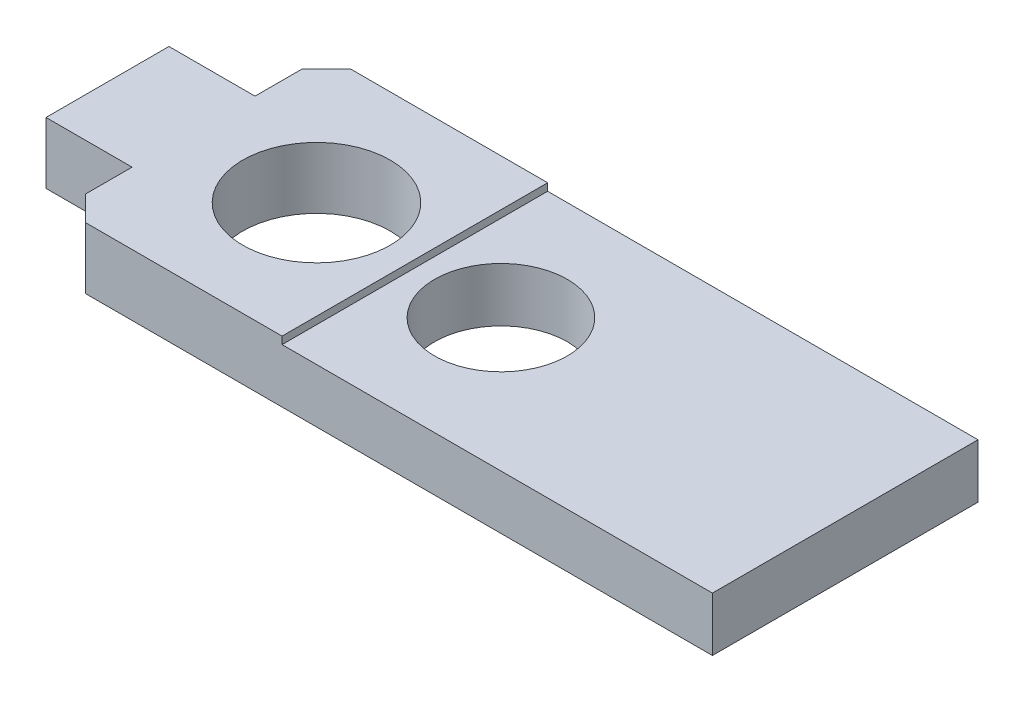
ISO-10303-21;
HEADER;
FILE_DESCRIPTION(('STEP AP214'),'2;1');
FILE_NAME('part.step','',(''),(''),'','','');
FILE_SCHEMA(('AUTOMOTIVE_DESIGN { 1 0 10303 214 1 1 1 1 }'));
ENDSEC;
DATA;
#1=APPLICATION_CONTEXT('core data for automotive mechanical design processes');
#2=APPLICATION_PROTOCOL_DEFINITION('international standard','automotive_design',2000,#1);
#3=PRODUCT_CONTEXT('',#1,'mechanical');
#4=PRODUCT('Part','Part','',(#3));
#5=PRODUCT_RELATED_PRODUCT_CATEGORY('part','',(#4));
#6=PRODUCT_DEFINITION_FORMATION('','',#4);
#7=PRODUCT_DEFINITION_CONTEXT('part definition',#1,'design');
#8=PRODUCT_DEFINITION('design','',#6,#7);
#9=PRODUCT_DEFINITION_SHAPE('','',#8);
#10=(LENGTH_UNIT() NAMED_UNIT(*) SI_UNIT(.MILLI.,.METRE.));
#11=(NAMED_UNIT(*) PLANE_ANGLE_UNIT() SI_UNIT($,.RADIAN.));
#12=(NAMED_UNIT(*) SI_UNIT($,.STERADIAN.) SOLID_ANGLE_UNIT());
#13=UNCERTAINTY_MEASURE_WITH_UNIT(LENGTH_MEASURE(1.E-05),#10,'distance_accuracy_value','');
#14=(GEOMETRIC_REPRESENTATION_CONTEXT(3) GLOBAL_UNCERTAINTY_ASSIGNED_CONTEXT((#13)) GLOBAL_UNIT_ASSIGNED_CONTEXT((#10,
#11,#12)) REPRESENTATION_CONTEXT('',''));
#15=CARTESIAN_POINT('',(0.,0.,0.));
#16=DIRECTION('',(0.,0.,1.));
#17=DIRECTION('',(1.,0.,0.));
#18=AXIS2_PLACEMENT_3D('',#15,#16,#17);
#19=CARTESIAN_POINT('',(-25.,25.,0.));
#20=DIRECTION('',(1.,0.,0.));
#21=DIRECTION('',(0.,0.,-1.));
#22=AXIS2_PLACEMENT_3D('',#19,#20,#21);
#23=PLANE('',#22);
#24=DIRECTION('',(0.,1.,0.));
#25=VECTOR('',#24,1.);
#26=CARTESIAN_POINT('',(-25.,3.88578058618805E-13,-54.));
#27=LINE('',#26,#25);
#28=CARTESIAN_POINT('',(-25.,25.,-54.));
#29=VERTEX_POINT('',#28);
#30=CARTESIAN_POINT('',(-25.,22.,-54.));
#31=VERTEX_POINT('',#30);
#32=EDGE_CURVE('E155',#29,#31,#27,.F.);
#33=ORIENTED_EDGE('',*,*,#32,.F.);
#34=DIRECTION('',(0.,0.,1.));
#35=VECTOR('',#34,1.);
#36=CARTESIAN_POINT('',(-25.,25.,0.));
#37=LINE('',#36,#35);
#38=CARTESIAN_POINT('',(-25.,25.,54.));
#39=VERTEX_POINT('',#38);
#40=EDGE_CURVE('E134',#39,#29,#37,.F.);
#41=ORIENTED_EDGE('',*,*,#40,.F.);
#42=DIRECTION('',(0.,1.,0.));
#43=VECTOR('',#42,1.);
#44=CARTESIAN_POINT('',(-25.,0.,54.));
#45=LINE('',#44,#43);
#46=CARTESIAN_POINT('',(-25.,22.,54.));
#47=VERTEX_POINT('',#46);
#48=EDGE_CURVE('E175',#47,#39,#45,.T.);
#49=ORIENTED_EDGE('',*,*,#48,.F.);
#50=DIRECTION('',(0.,0.,-1.));
#51=VECTOR('',#50,1.);
#52=CARTESIAN_POINT('',(-25.,22.,54.));
#53=LINE('',#52,#51);
#54=EDGE_CURVE('E144',#47,#31,#53,.T.);
#55=ORIENTED_EDGE('',*,*,#54,.T.);
#56=EDGE_LOOP('',(#33,#41,#49,#55));
#57=FACE_BOUND('',#56,.T.);
#58=ADVANCED_FACE('F24',(#57),#23,.T.);
#59=CARTESIAN_POINT('',(150.,22.,54.));
#60=DIRECTION('',(0.,-1.,0.));
#61=DIRECTION('',(0.,0.,-1.));
#62=AXIS2_PLACEMENT_3D('',#59,#60,#61);
#63=PLANE('',#62);
#64=CARTESIAN_POINT('',(10.,22.,0.));
#65=DIRECTION('',(0.,-1.,0.));
#66=DIRECTION('',(0.,0.,-1.));
#67=AXIS2_PLACEMENT_3D('',#64,#65,#66);
#68=CIRCLE('',#67,27.);
#69=CARTESIAN_POINT('',(10.,22.,-27.));
#70=VERTEX_POINT('',#69);
#71=EDGE_CURVE('E27',#70,#70,#68,.T.);
#72=ORIENTED_EDGE('',*,*,#71,.T.);
#73=EDGE_LOOP('',(#72));
#74=FACE_BOUND('',#73,.T.);
#75=DIRECTION('',(-1.,0.,0.));
#76=VECTOR('',#75,1.);
#77=CARTESIAN_POINT('',(150.,22.,-54.));
#78=LINE('',#77,#76);
#79=CARTESIAN_POINT('',(150.,22.,-54.));
#80=VERTEX_POINT('',#79);
#81=EDGE_CURVE('E168',#31,#80,#78,.F.);
#82=ORIENTED_EDGE('',*,*,#81,.F.);
#83=ORIENTED_EDGE('',*,*,#54,.F.);
#84=DIRECTION('',(1.,0.,0.));
#85=VECTOR('',#84,1.);
#86=CARTESIAN_POINT('',(-115.,22.,54.));
#87=LINE('',#86,#85);
#88=CARTESIAN_POINT('',(150.,22.,54.));
#89=VERTEX_POINT('',#88);
#90=EDGE_CURVE('E178',#89,#47,#87,.F.);
#91=ORIENTED_EDGE('',*,*,#90,.F.);
#92=DIRECTION('',(0.,0.,-1.));
#93=VECTOR('',#92,1.);
#94=CARTESIAN_POINT('',(150.,22.,54.));
#95=LINE('',#94,#93);
#96=EDGE_CURVE('E170',#80,#89,#95,.F.);
#97=ORIENTED_EDGE('',*,*,#96,.F.);
#98=EDGE_LOOP('',(#82,#83,#91,#97));
#99=FACE_BOUND('',#98,.T.);
#100=ADVANCED_FACE('F258',(#74,#99),#63,.F.);
#101=CARTESIAN_POINT('',(0.,25.,0.));
#102=DIRECTION('',(0.,1.,0.));
#103=DIRECTION('',(0.,0.,1.));
#104=AXIS2_PLACEMENT_3D('',#101,#102,#103);
#105=PLANE('',#104);
#106=CARTESIAN_POINT('',(-65.,25.,0.));
#107=DIRECTION('',(0.,-1.,0.));
#108=DIRECTION('',(0.,0.,-1.));
#109=AXIS2_PLACEMENT_3D('',#106,#107,#108);
#110=CIRCLE('',#109,30.);
#111=CARTESIAN_POINT('',(-65.,25.,-30.));
#112=VERTEX_POINT('',#111);
#113=EDGE_CURVE('E148',#112,#112,#110,.T.);
#114=ORIENTED_EDGE('',*,*,#113,.T.);
#115=EDGE_LOOP('',(#114));
#116=FACE_BOUND('',#115,.T.);
#117=DIRECTION('',(1.,0.,0.));
#118=VECTOR('',#117,1.);
#119=CARTESIAN_POINT('',(-115.,25.,54.));
#120=LINE('',#119,#118);
#121=CARTESIAN_POINT('',(-105.,25.,54.));
#122=VERTEX_POINT('',#121);
#123=EDGE_CURVE('E183',#39,#122,#120,.F.);
#124=ORIENTED_EDGE('',*,*,#123,.F.);
#125=ORIENTED_EDGE('',*,*,#40,.T.);
#126=DIRECTION('',(-1.,0.,0.));
#127=VECTOR('',#126,1.);
#128=CARTESIAN_POINT('',(150.,25.,-54.));
#129=LINE('',#128,#127);
#130=CARTESIAN_POINT('',(-105.,25.,-54.));
#131=VERTEX_POINT('',#130);
#132=EDGE_CURVE('E130',#131,#29,#129,.F.);
#133=ORIENTED_EDGE('',*,*,#132,.F.);
#134=DIRECTION('',(-0.707106781186548,0.,0.707106781186548));
#135=VECTOR('',#134,1.);
#136=CARTESIAN_POINT('',(-110.,25.,-49.));
#137=LINE('',#136,#135);
#138=CARTESIAN_POINT('',(-115.,25.,-44.));
#139=VERTEX_POINT('',#138);
#140=EDGE_CURVE('E124',#139,#131,#137,.F.);
#141=ORIENTED_EDGE('',*,*,#140,.F.);
#142=DIRECTION('',(0.,0.,1.));
#143=VECTOR('',#142,1.);
#144=CARTESIAN_POINT('',(-115.,25.,-54.));
#145=LINE('',#144,#143);
#146=CARTESIAN_POINT('',(-115.,25.,-25.));
#147=VERTEX_POINT('',#146);
#148=EDGE_CURVE('E115',#147,#139,#145,.F.);
#149=ORIENTED_EDGE('',*,*,#148,.F.);
#150=DIRECTION('',(-1.,0.,0.));
#151=VECTOR('',#150,1.);
#152=CARTESIAN_POINT('',(-115.,25.,-25.));
#153=LINE('',#152,#151);
#154=CARTESIAN_POINT('',(-150.,25.,-25.));
#155=VERTEX_POINT('',#154);
#156=EDGE_CURVE('E110',#155,#147,#153,.F.);
#157=ORIENTED_EDGE('',*,*,#156,.F.);
#158=DIRECTION('',(0.,0.,1.));
#159=VECTOR('',#158,1.);
#160=CARTESIAN_POINT('',(-150.,25.,-25.));
#161=LINE('',#160,#159);
#162=CARTESIAN_POINT('',(-150.,25.,25.));
#163=VERTEX_POINT('',#162);
#164=EDGE_CURVE('E199',#163,#155,#161,.F.);
#165=ORIENTED_EDGE('',*,*,#164,.F.);
#166=DIRECTION('',(1.,0.,0.));
#167=VECTOR('',#166,1.);
#168=CARTESIAN_POINT('',(-150.,25.,25.));
#169=LINE('',#168,#167);
#170=CARTESIAN_POINT('',(-115.,25.,25.));
#171=VERTEX_POINT('',#170);
#172=EDGE_CURVE('E195',#171,#163,#169,.F.);
#173=ORIENTED_EDGE('',*,*,#172,.F.);
#174=DIRECTION('',(0.,0.,1.));
#175=VECTOR('',#174,1.);
#176=CARTESIAN_POINT('',(-115.,25.,25.));
#177=LINE('',#176,#175);
#178=CARTESIAN_POINT('',(-115.,25.,44.));
#179=VERTEX_POINT('',#178);
#180=EDGE_CURVE('E191',#179,#171,#177,.F.);
#181=ORIENTED_EDGE('',*,*,#180,.F.);
#182=DIRECTION('',(0.707106781186548,0.,0.707106781186548));
#183=VECTOR('',#182,1.);
#184=CARTESIAN_POINT('',(-110.,25.,49.));
#185=LINE('',#184,#183);
#186=EDGE_CURVE('E187',#122,#179,#185,.F.);
#187=ORIENTED_EDGE('',*,*,#186,.F.);
#188=EDGE_LOOP('',(#124,#125,#133,#141,#149,#157,#165,#173,#181,#187));
#189=FACE_BOUND('',#188,.T.);
#190=ADVANCED_FACE('F128',(#116,#189),#105,.T.);
#191=CARTESIAN_POINT('',(-110.,12.5000000000004,-49.));
#192=DIRECTION('',(-0.707106781186548,0.,-0.707106781186548));
#193=DIRECTION('',(-0.707106781186548,0.,0.707106781186548));
#194=AXIS2_PLACEMENT_3D('',#191,#192,#193);
#195=PLANE('',#194);
#196=DIRECTION('',(0.,1.,0.));
#197=VECTOR('',#196,1.);
#198=CARTESIAN_POINT('',(-105.,3.88578058618805E-13,-54.));
#199=LINE('',#198,#197);
#200=CARTESIAN_POINT('',(-105.,3.7470027081099E-13,-54.));
#201=VERTEX_POINT('',#200);
#202=EDGE_CURVE('E162',#201,#131,#199,.T.);
#203=ORIENTED_EDGE('',*,*,#202,.F.);
#204=DIRECTION('',(-0.707106781186548,0.,0.707106781186547));
#205=VECTOR('',#204,1.);
#206=CARTESIAN_POINT('',(-105.,3.88578058618805E-13,-54.));
#207=LINE('',#206,#205);
#208=CARTESIAN_POINT('',(-115.,3.7470027081099E-13,-44.));
#209=VERTEX_POINT('',#208);
#210=EDGE_CURVE('E138',#201,#209,#207,.T.);
#211=ORIENTED_EDGE('',*,*,#210,.T.);
#212=DIRECTION('',(0.,1.,0.));
#213=VECTOR('',#212,1.);
#214=CARTESIAN_POINT('',(-115.,3.88578058618805E-13,-44.));
#215=LINE('',#214,#213);
#216=EDGE_CURVE('E120',#139,#209,#215,.F.);
#217=ORIENTED_EDGE('',*,*,#216,.F.);
#218=ORIENTED_EDGE('',*,*,#140,.T.);
#219=EDGE_LOOP('',(#203,#211,#217,#218));
#220=FACE_BOUND('',#219,.T.);
#221=ADVANCED_FACE('F137',(#220),#195,.T.);
#222=CARTESIAN_POINT('',(-115.,3.88578058618805E-13,-54.));
#223=DIRECTION('',(-1.,0.,0.));
#224=DIRECTION('',(0.,0.,1.));
#225=AXIS2_PLACEMENT_3D('',#222,#223,#224);
#226=PLANE('',#225);
#227=ORIENTED_EDGE('',*,*,#148,.T.);
#228=ORIENTED_EDGE('',*,*,#216,.T.);
#229=DIRECTION('',(0.,0.,1.));
#230=VECTOR('',#229,1.);
#231=CARTESIAN_POINT('',(-115.,0.,0.));
#232=LINE('',#231,#230);
#233=CARTESIAN_POINT('',(-115.,0.,-25.));
#234=VERTEX_POINT('',#233);
#235=EDGE_CURVE('E152',#209,#234,#232,.T.);
#236=ORIENTED_EDGE('',*,*,#235,.T.);
#237=DIRECTION('',(0.,1.,0.));
#238=VECTOR('',#237,1.);
#239=CARTESIAN_POINT('',(-115.,0.,-25.));
#240=LINE('',#239,#238);
#241=EDGE_CURVE('E122',#147,#234,#240,.F.);
#242=ORIENTED_EDGE('',*,*,#241,.F.);
#243=EDGE_LOOP('',(#227,#228,#236,#242));
#244=FACE_BOUND('',#243,.T.);
#245=ADVANCED_FACE('F117',(#244),#226,.T.);
#246=CARTESIAN_POINT('',(-115.,0.,-25.));
#247=DIRECTION('',(0.,0.,-1.));
#248=DIRECTION('',(-1.,0.,0.));
#249=AXIS2_PLACEMENT_3D('',#246,#247,#248);
#250=PLANE('',#249);
#251=ORIENTED_EDGE('',*,*,#241,.T.);
#252=DIRECTION('',(1.,0.,0.));
#253=VECTOR('',#252,1.);
#254=CARTESIAN_POINT('',(0.,0.,-25.));
#255=LINE('',#254,#253);
#256=CARTESIAN_POINT('',(-150.,0.,-25.));
#257=VERTEX_POINT('',#256);
#258=EDGE_CURVE('E203',#234,#257,#255,.F.);
#259=ORIENTED_EDGE('',*,*,#258,.T.);
#260=DIRECTION('',(0.,1.,0.));
#261=VECTOR('',#260,1.);
#262=CARTESIAN_POINT('',(-150.,0.,-25.));
#263=LINE('',#262,#261);
#264=EDGE_CURVE('E197',#155,#257,#263,.F.);
#265=ORIENTED_EDGE('',*,*,#264,.F.);
#266=ORIENTED_EDGE('',*,*,#156,.T.);
#267=EDGE_LOOP('',(#251,#259,#265,#266));
#268=FACE_BOUND('',#267,.T.);
#269=ADVANCED_FACE('F202',(#268),#250,.T.);
#270=CARTESIAN_POINT('',(-150.,0.,-25.));
#271=DIRECTION('',(-1.,0.,0.));
#272=DIRECTION('',(0.,0.,1.));
#273=AXIS2_PLACEMENT_3D('',#270,#271,#272);
#274=PLANE('',#273);
#275=ORIENTED_EDGE('',*,*,#264,.T.);
#276=DIRECTION('',(0.,0.,1.));
#277=VECTOR('',#276,1.);
#278=CARTESIAN_POINT('',(-150.,0.,0.));
#279=LINE('',#278,#277);
#280=CARTESIAN_POINT('',(-150.,0.,25.));
#281=VERTEX_POINT('',#280);
#282=EDGE_CURVE('E210',#257,#281,#279,.T.);
#283=ORIENTED_EDGE('',*,*,#282,.T.);
#284=DIRECTION('',(0.,1.,0.));
#285=VECTOR('',#284,1.);
#286=CARTESIAN_POINT('',(-150.,0.,25.));
#287=LINE('',#286,#285);
#288=EDGE_CURVE('E193',#163,#281,#287,.F.);
#289=ORIENTED_EDGE('',*,*,#288,.F.);
#290=ORIENTED_EDGE('',*,*,#164,.T.);
#291=EDGE_LOOP('',(#275,#283,#289,#290));
#292=FACE_BOUND('',#291,.T.);
#293=ADVANCED_FACE('F255',(#292),#274,.T.);
#294=CARTESIAN_POINT('',(-150.,0.,25.));
#295=DIRECTION('',(0.,0.,1.));
#296=DIRECTION('',(1.,0.,0.));
#297=AXIS2_PLACEMENT_3D('',#294,#295,#296);
#298=PLANE('',#297);
#299=ORIENTED_EDGE('',*,*,#288,.T.);
#300=DIRECTION('',(1.,0.,0.));
#301=VECTOR('',#300,1.);
#302=CARTESIAN_POINT('',(0.,0.,25.));
#303=LINE('',#302,#301);
#304=CARTESIAN_POINT('',(-115.,0.,25.));
#305=VERTEX_POINT('',#304);
#306=EDGE_CURVE('E214',#281,#305,#303,.T.);
#307=ORIENTED_EDGE('',*,*,#306,.T.);
#308=DIRECTION('',(0.,1.,0.));
#309=VECTOR('',#308,1.);
#310=CARTESIAN_POINT('',(-115.,0.,25.));
#311=LINE('',#310,#309);
#312=EDGE_CURVE('E189',#171,#305,#311,.F.);
#313=ORIENTED_EDGE('',*,*,#312,.F.);
#314=ORIENTED_EDGE('',*,*,#172,.T.);
#315=EDGE_LOOP('',(#299,#307,#313,#314));
#316=FACE_BOUND('',#315,.T.);
#317=ADVANCED_FACE('F251',(#316),#298,.T.);
#318=CARTESIAN_POINT('',(-115.,0.,25.));
#319=DIRECTION('',(-1.,0.,0.));
#320=DIRECTION('',(0.,0.,1.));
#321=AXIS2_PLACEMENT_3D('',#318,#319,#320);
#322=PLANE('',#321);
#323=DIRECTION('',(0.,0.,1.));
#324=VECTOR('',#323,1.);
#325=CARTESIAN_POINT('',(-115.,0.,0.));
#326=LINE('',#325,#324);
#327=CARTESIAN_POINT('',(-115.,0.,44.));
#328=VERTEX_POINT('',#327);
#329=EDGE_CURVE('E217',#305,#328,#326,.T.);
#330=ORIENTED_EDGE('',*,*,#329,.T.);
#331=DIRECTION('',(0.,1.,0.));
#332=VECTOR('',#331,1.);
#333=CARTESIAN_POINT('',(-115.,12.5,44.));
#334=LINE('',#333,#332);
#335=EDGE_CURVE('E185',#179,#328,#334,.F.);
#336=ORIENTED_EDGE('',*,*,#335,.F.);
#337=ORIENTED_EDGE('',*,*,#180,.T.);
#338=ORIENTED_EDGE('',*,*,#312,.T.);
#339=EDGE_LOOP('',(#330,#336,#337,#338));
#340=FACE_BOUND('',#339,.T.);
#341=ADVANCED_FACE('F247',(#340),#322,.T.);
#342=CARTESIAN_POINT('',(-110.,12.5,49.));
#343=DIRECTION('',(-0.707106781186548,0.,0.707106781186548));
#344=DIRECTION('',(0.707106781186548,0.,0.707106781186548));
#345=AXIS2_PLACEMENT_3D('',#342,#343,#344);
#346=PLANE('',#345);
#347=ORIENTED_EDGE('',*,*,#335,.T.);
#348=DIRECTION('',(0.707106781186548,0.,0.707106781186547));
#349=VECTOR('',#348,1.);
#350=CARTESIAN_POINT('',(-115.,0.,44.));
#351=LINE('',#350,#349);
#352=CARTESIAN_POINT('',(-105.,0.,54.));
#353=VERTEX_POINT('',#352);
#354=EDGE_CURVE('E220',#328,#353,#351,.T.);
#355=ORIENTED_EDGE('',*,*,#354,.T.);
#356=DIRECTION('',(0.,1.,0.));
#357=VECTOR('',#356,1.);
#358=CARTESIAN_POINT('',(-105.,0.,54.));
#359=LINE('',#358,#357);
#360=EDGE_CURVE('E181',#122,#353,#359,.F.);
#361=ORIENTED_EDGE('',*,*,#360,.F.);
#362=ORIENTED_EDGE('',*,*,#186,.T.);
#363=EDGE_LOOP('',(#347,#355,#361,#362));
#364=FACE_BOUND('',#363,.T.);
#365=ADVANCED_FACE('F242',(#364),#346,.T.);
#366=CARTESIAN_POINT('',(-115.,0.,54.));
#367=DIRECTION('',(0.,0.,1.));
#368=DIRECTION('',(1.,0.,0.));
#369=AXIS2_PLACEMENT_3D('',#366,#367,#368);
#370=PLANE('',#369);
#371=ORIENTED_EDGE('',*,*,#90,.T.);
#372=ORIENTED_EDGE('',*,*,#48,.T.);
#373=ORIENTED_EDGE('',*,*,#123,.T.);
#374=ORIENTED_EDGE('',*,*,#360,.T.);
#375=DIRECTION('',(1.,0.,0.));
#376=VECTOR('',#375,1.);
#377=CARTESIAN_POINT('',(0.,0.,54.));
#378=LINE('',#377,#376);
#379=CARTESIAN_POINT('',(150.,0.,54.));
#380=VERTEX_POINT('',#379);
#381=EDGE_CURVE('E223',#353,#380,#378,.T.);
#382=ORIENTED_EDGE('',*,*,#381,.T.);
#383=DIRECTION('',(0.,1.,0.));
#384=VECTOR('',#383,1.);
#385=CARTESIAN_POINT('',(150.,0.,54.));
#386=LINE('',#385,#384);
#387=EDGE_CURVE('E173',#89,#380,#386,.F.);
#388=ORIENTED_EDGE('',*,*,#387,.F.);
#389=EDGE_LOOP('',(#371,#372,#373,#374,#382,#388));
#390=FACE_BOUND('',#389,.T.);
#391=ADVANCED_FACE('F236',(#390),#370,.T.);
#392=CARTESIAN_POINT('',(150.,0.,54.));
#393=DIRECTION('',(1.,0.,0.));
#394=DIRECTION('',(0.,0.,-1.));
#395=AXIS2_PLACEMENT_3D('',#392,#393,#394);
#396=PLANE('',#395);
#397=DIRECTION('',(0.,1.,0.));
#398=VECTOR('',#397,1.);
#399=CARTESIAN_POINT('',(150.,3.88578058618805E-13,-54.));
#400=LINE('',#399,#398);
#401=CARTESIAN_POINT('',(150.,3.88578058618805E-13,-54.));
#402=VERTEX_POINT('',#401);
#403=EDGE_CURVE('E42',#80,#402,#400,.F.);
#404=ORIENTED_EDGE('',*,*,#403,.F.);
#405=ORIENTED_EDGE('',*,*,#96,.T.);
#406=ORIENTED_EDGE('',*,*,#387,.T.);
#407=DIRECTION('',(0.,0.,1.));
#408=VECTOR('',#407,1.);
#409=CARTESIAN_POINT('',(150.,0.,0.));
#410=LINE('',#409,#408);
#411=EDGE_CURVE('E226',#380,#402,#410,.F.);
#412=ORIENTED_EDGE('',*,*,#411,.T.);
#413=EDGE_LOOP('',(#404,#405,#406,#412));
#414=FACE_BOUND('',#413,.T.);
#415=ADVANCED_FACE('F232',(#414),#396,.T.);
#416=CARTESIAN_POINT('',(150.,3.88578058618805E-13,-54.));
#417=DIRECTION('',(0.,0.,-1.));
#418=DIRECTION('',(-1.,0.,0.));
#419=AXIS2_PLACEMENT_3D('',#416,#417,#418);
#420=PLANE('',#419);
#421=ORIENTED_EDGE('',*,*,#132,.T.);
#422=ORIENTED_EDGE('',*,*,#32,.T.);
#423=ORIENTED_EDGE('',*,*,#81,.T.);
#424=ORIENTED_EDGE('',*,*,#403,.T.);
#425=DIRECTION('',(1.,0.,0.));
#426=VECTOR('',#425,1.);
#427=CARTESIAN_POINT('',(0.,3.88578058618805E-13,-54.));
#428=LINE('',#427,#426);
#429=EDGE_CURVE('E147',#402,#201,#428,.F.);
#430=ORIENTED_EDGE('',*,*,#429,.T.);
#431=ORIENTED_EDGE('',*,*,#202,.T.);
#432=EDGE_LOOP('',(#421,#422,#423,#424,#430,#431));
#433=FACE_BOUND('',#432,.T.);
#434=ADVANCED_FACE('F229',(#433),#420,.T.);
#435=CARTESIAN_POINT('',(10.,25.,0.));
#436=DIRECTION('',(0.,-1.,0.));
#437=DIRECTION('',(0.,0.,-1.));
#438=AXIS2_PLACEMENT_3D('',#435,#436,#437);
#439=CYLINDRICAL_SURFACE('',#438,27.);
#440=CARTESIAN_POINT('',(10.,0.,0.));
#441=DIRECTION('',(0.,-1.,0.));
#442=DIRECTION('',(0.,0.,-1.));
#443=AXIS2_PLACEMENT_3D('',#440,#441,#442);
#444=CIRCLE('',#443,27.);
#445=CARTESIAN_POINT('',(10.,0.,-27.));
#446=VERTEX_POINT('',#445);
#447=EDGE_CURVE('E33',#446,#446,#444,.T.);
#448=ORIENTED_EDGE('',*,*,#447,.T.);
#449=EDGE_LOOP('',(#448));
#450=FACE_BOUND('',#449,.T.);
#451=ORIENTED_EDGE('',*,*,#71,.F.);
#452=EDGE_LOOP('',(#451));
#453=FACE_BOUND('',#452,.T.);
#454=ADVANCED_FACE('F273',(#450,#453),#439,.F.);
#455=CARTESIAN_POINT('',(-65.,25.,0.));
#456=DIRECTION('',(0.,-1.,0.));
#457=DIRECTION('',(0.,0.,-1.));
#458=AXIS2_PLACEMENT_3D('',#455,#456,#457);
#459=CYLINDRICAL_SURFACE('',#458,30.);
#460=ORIENTED_EDGE('',*,*,#113,.F.);
#461=EDGE_LOOP('',(#460));
#462=FACE_BOUND('',#461,.T.);
#463=CARTESIAN_POINT('',(-65.,0.,0.));
#464=DIRECTION('',(0.,-1.,0.));
#465=DIRECTION('',(0.,0.,-1.));
#466=AXIS2_PLACEMENT_3D('',#463,#464,#465);
#467=CIRCLE('',#466,30.);
#468=CARTESIAN_POINT('',(-65.,0.,-30.));
#469=VERTEX_POINT('',#468);
#470=EDGE_CURVE('E13',#469,#469,#467,.T.);
#471=ORIENTED_EDGE('',*,*,#470,.T.);
#472=EDGE_LOOP('',(#471));
#473=FACE_BOUND('',#472,.T.);
#474=ADVANCED_FACE('F267',(#462,#473),#459,.F.);
#475=CARTESIAN_POINT('',(0.,0.,0.));
#476=DIRECTION('',(0.,1.,0.));
#477=DIRECTION('',(0.,0.,1.));
#478=AXIS2_PLACEMENT_3D('',#475,#476,#477);
#479=PLANE('',#478);
#480=ORIENTED_EDGE('',*,*,#470,.F.);
#481=EDGE_LOOP('',(#480));
#482=FACE_BOUND('',#481,.T.);
#483=ORIENTED_EDGE('',*,*,#447,.F.);
#484=EDGE_LOOP('',(#483));
#485=FACE_BOUND('',#484,.T.);
#486=ORIENTED_EDGE('',*,*,#411,.F.);
#487=ORIENTED_EDGE('',*,*,#381,.F.);
#488=ORIENTED_EDGE('',*,*,#354,.F.);
#489=ORIENTED_EDGE('',*,*,#329,.F.);
#490=ORIENTED_EDGE('',*,*,#306,.F.);
#491=ORIENTED_EDGE('',*,*,#282,.F.);
#492=ORIENTED_EDGE('',*,*,#258,.F.);
#493=ORIENTED_EDGE('',*,*,#235,.F.);
#494=ORIENTED_EDGE('',*,*,#210,.F.);
#495=ORIENTED_EDGE('',*,*,#429,.F.);
#496=EDGE_LOOP('',(#486,#487,#488,#489,#490,#491,#492,#493,#494,#495));
#497=FACE_BOUND('',#496,.T.);
#498=ADVANCED_FACE('F207',(#482,#485,#497),#479,.F.);
#499=CLOSED_SHELL('',(#58,#100,#190,#221,#245,#269,#293,#317,#341,#365,#391,#415,#434,#454,#474,#498));
#500=MANIFOLD_SOLID_BREP('B1',#499);
#501=ADVANCED_BREP_SHAPE_REPRESENTATION('',(#18,#500),#14);
#502=SHAPE_DEFINITION_REPRESENTATION(#9,#501);
ENDSEC;
END-ISO-10303-21;
